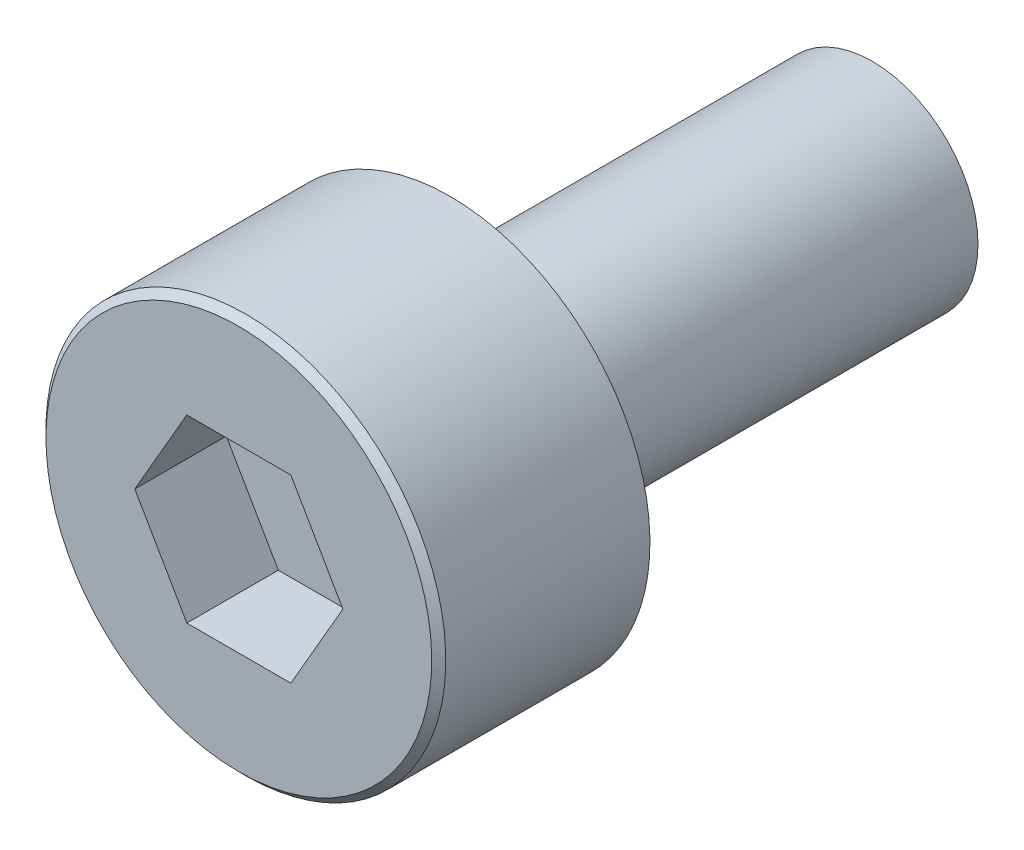
ISO-10303-21;
HEADER;
FILE_DESCRIPTION(('STEP AP214'),'2;1');
FILE_NAME('part.step','',(''),(''),'','','');
FILE_SCHEMA(('AUTOMOTIVE_DESIGN { 1 0 10303 214 1 1 1 1 }'));
ENDSEC;
DATA;
#1=APPLICATION_CONTEXT('core data for automotive mechanical design processes');
#2=APPLICATION_PROTOCOL_DEFINITION('international standard','automotive_design',2000,#1);
#3=PRODUCT_CONTEXT('',#1,'mechanical');
#4=PRODUCT('Part','Part','',(#3));
#5=PRODUCT_RELATED_PRODUCT_CATEGORY('part','',(#4));
#6=PRODUCT_DEFINITION_FORMATION('','',#4);
#7=PRODUCT_DEFINITION_CONTEXT('part definition',#1,'design');
#8=PRODUCT_DEFINITION('design','',#6,#7);
#9=PRODUCT_DEFINITION_SHAPE('','',#8);
#10=(LENGTH_UNIT() NAMED_UNIT(*) SI_UNIT(.MILLI.,.METRE.));
#11=(NAMED_UNIT(*) PLANE_ANGLE_UNIT() SI_UNIT($,.RADIAN.));
#12=(NAMED_UNIT(*) SI_UNIT($,.STERADIAN.) SOLID_ANGLE_UNIT());
#13=UNCERTAINTY_MEASURE_WITH_UNIT(LENGTH_MEASURE(1.E-05),#10,'distance_accuracy_value','');
#14=(GEOMETRIC_REPRESENTATION_CONTEXT(3) GLOBAL_UNCERTAINTY_ASSIGNED_CONTEXT((#13)) GLOBAL_UNIT_ASSIGNED_CONTEXT((#10,
#11,#12)) REPRESENTATION_CONTEXT('',''));
#15=CARTESIAN_POINT('',(0.,0.,0.));
#16=DIRECTION('',(0.,0.,1.));
#17=DIRECTION('',(1.,0.,0.));
#18=AXIS2_PLACEMENT_3D('',#15,#16,#17);
#19=CARTESIAN_POINT('',(0.,0.,0.));
#20=DIRECTION('',(0.,0.,1.));
#21=DIRECTION('',(0.,-1.,0.));
#22=AXIS2_PLACEMENT_3D('',#19,#20,#21);
#23=PLANE('',#22);
#24=CARTESIAN_POINT('',(0.,0.,0.));
#25=DIRECTION('',(0.,0.,1.));
#26=DIRECTION('',(0.,-1.,0.));
#27=AXIS2_PLACEMENT_3D('',#24,#25,#26);
#28=CIRCLE('',#27,2.74);
#29=CARTESIAN_POINT('',(0.,-2.74,0.));
#30=VERTEX_POINT('',#29);
#31=EDGE_CURVE('E11',#30,#30,#28,.T.);
#32=ORIENTED_EDGE('',*,*,#31,.T.);
#33=EDGE_LOOP('',(#32));
#34=FACE_BOUND('',#33,.T.);
#35=DIRECTION('',(-0.5,0.866025403784439,0.));
#36=VECTOR('',#35,1.);
#37=CARTESIAN_POINT('',(1.47801668912544,0.,0.));
#38=LINE('',#37,#36);
#39=CARTESIAN_POINT('',(1.47801668912544,0.,0.));
#40=VERTEX_POINT('',#39);
#41=CARTESIAN_POINT('',(0.739008344562721,1.28,0.));
#42=VERTEX_POINT('',#41);
#43=EDGE_CURVE('E58',#40,#42,#38,.T.);
#44=ORIENTED_EDGE('',*,*,#43,.F.);
#45=DIRECTION('',(0.5,0.866025403784439,0.));
#46=VECTOR('',#45,1.);
#47=CARTESIAN_POINT('',(0.739008344562721,-1.28,0.));
#48=LINE('',#47,#46);
#49=CARTESIAN_POINT('',(0.739008344562721,-1.28,0.));
#50=VERTEX_POINT('',#49);
#51=EDGE_CURVE('E141',#50,#40,#48,.T.);
#52=ORIENTED_EDGE('',*,*,#51,.F.);
#53=DIRECTION('',(1.,0.,0.));
#54=VECTOR('',#53,1.);
#55=CARTESIAN_POINT('',(-0.739008344562721,-1.28,0.));
#56=LINE('',#55,#54);
#57=CARTESIAN_POINT('',(-0.739008344562721,-1.28,0.));
#58=VERTEX_POINT('',#57);
#59=EDGE_CURVE('E139',#58,#50,#56,.T.);
#60=ORIENTED_EDGE('',*,*,#59,.F.);
#61=DIRECTION('',(0.5,-0.866025403784439,0.));
#62=VECTOR('',#61,1.);
#63=CARTESIAN_POINT('',(-1.47801668912544,0.,0.));
#64=LINE('',#63,#62);
#65=CARTESIAN_POINT('',(-1.47801668912544,0.,0.));
#66=VERTEX_POINT('',#65);
#67=EDGE_CURVE('E106',#66,#58,#64,.T.);
#68=ORIENTED_EDGE('',*,*,#67,.F.);
#69=DIRECTION('',(-0.5,-0.866025403784439,0.));
#70=VECTOR('',#69,1.);
#71=CARTESIAN_POINT('',(-0.739008344562721,1.28,0.));
#72=LINE('',#71,#70);
#73=CARTESIAN_POINT('',(-0.739008344562721,1.28,0.));
#74=VERTEX_POINT('',#73);
#75=EDGE_CURVE('E135',#74,#66,#72,.T.);
#76=ORIENTED_EDGE('',*,*,#75,.F.);
#77=DIRECTION('',(-1.,0.,0.));
#78=VECTOR('',#77,1.);
#79=CARTESIAN_POINT('',(0.739008344562721,1.28,0.));
#80=LINE('',#79,#78);
#81=EDGE_CURVE('E132',#42,#74,#80,.T.);
#82=ORIENTED_EDGE('',*,*,#81,.F.);
#83=EDGE_LOOP('',(#44,#52,#60,#68,#76,#82));
#84=FACE_BOUND('',#83,.T.);
#85=ADVANCED_FACE('F42',(#34,#84),#23,.T.);
#86=CARTESIAN_POINT('',(0.,0.,-9.));
#87=DIRECTION('',(0.,0.,-1.));
#88=DIRECTION('',(0.,1.,0.));
#89=AXIS2_PLACEMENT_3D('',#86,#87,#88);
#90=CYLINDRICAL_SURFACE('',#89,2.84);
#91=CARTESIAN_POINT('',(0.,0.,-0.0999999999999977));
#92=DIRECTION('',(0.,0.,1.));
#93=DIRECTION('',(0.,-1.,0.));
#94=AXIS2_PLACEMENT_3D('',#91,#92,#93);
#95=CIRCLE('',#94,2.84);
#96=CARTESIAN_POINT('',(0.,-2.84,-0.0999999999999981));
#97=VERTEX_POINT('',#96);
#98=EDGE_CURVE('E51',#97,#97,#95,.F.);
#99=ORIENTED_EDGE('',*,*,#98,.T.);
#100=EDGE_LOOP('',(#99));
#101=FACE_BOUND('',#100,.T.);
#102=CARTESIAN_POINT('',(0.,0.,-3.));
#103=DIRECTION('',(0.,0.,-1.));
#104=DIRECTION('',(0.,1.,0.));
#105=AXIS2_PLACEMENT_3D('',#102,#103,#104);
#106=CIRCLE('',#105,2.84);
#107=CARTESIAN_POINT('',(0.,2.84,-3.));
#108=VERTEX_POINT('',#107);
#109=EDGE_CURVE('E156',#108,#108,#106,.T.);
#110=ORIENTED_EDGE('',*,*,#109,.F.);
#111=EDGE_LOOP('',(#110));
#112=FACE_BOUND('',#111,.T.);
#113=ADVANCED_FACE('F161',(#101,#112),#90,.T.);
#114=CARTESIAN_POINT('',(0.,2.84,-3.));
#115=DIRECTION('',(0.,0.,-1.));
#116=DIRECTION('',(0.,1.,0.));
#117=AXIS2_PLACEMENT_3D('',#114,#115,#116);
#118=PLANE('',#117);
#119=ORIENTED_EDGE('',*,*,#109,.T.);
#120=EDGE_LOOP('',(#119));
#121=FACE_BOUND('',#120,.T.);
#122=CARTESIAN_POINT('',(0.,0.,-3.));
#123=DIRECTION('',(0.,0.,-1.));
#124=DIRECTION('',(0.,1.,0.));
#125=AXIS2_PLACEMENT_3D('',#122,#123,#124);
#126=CIRCLE('',#125,1.5);
#127=CARTESIAN_POINT('',(0.,1.5,-3.));
#128=VERTEX_POINT('',#127);
#129=EDGE_CURVE('E153',#128,#128,#126,.T.);
#130=ORIENTED_EDGE('',*,*,#129,.F.);
#131=EDGE_LOOP('',(#130));
#132=FACE_BOUND('',#131,.T.);
#133=ADVANCED_FACE('F177',(#121,#132),#118,.T.);
#134=CARTESIAN_POINT('',(0.,0.,-9.));
#135=DIRECTION('',(0.,0.,-1.));
#136=DIRECTION('',(0.,1.,0.));
#137=AXIS2_PLACEMENT_3D('',#134,#135,#136);
#138=CYLINDRICAL_SURFACE('',#137,1.5);
#139=ORIENTED_EDGE('',*,*,#129,.T.);
#140=EDGE_LOOP('',(#139));
#141=FACE_BOUND('',#140,.T.);
#142=CARTESIAN_POINT('',(0.,0.,-9.));
#143=DIRECTION('',(0.,0.,-1.));
#144=DIRECTION('',(0.,1.,0.));
#145=AXIS2_PLACEMENT_3D('',#142,#143,#144);
#146=CIRCLE('',#145,1.5);
#147=CARTESIAN_POINT('',(0.,1.5,-9.));
#148=VERTEX_POINT('',#147);
#149=EDGE_CURVE('E145',#148,#148,#146,.T.);
#150=ORIENTED_EDGE('',*,*,#149,.F.);
#151=EDGE_LOOP('',(#150));
#152=FACE_BOUND('',#151,.T.);
#153=ADVANCED_FACE('F183',(#141,#152),#138,.T.);
#154=CARTESIAN_POINT('',(0.,1.5,-9.));
#155=DIRECTION('',(0.,0.,-1.));
#156=DIRECTION('',(0.,1.,0.));
#157=AXIS2_PLACEMENT_3D('',#154,#155,#156);
#158=PLANE('',#157);
#159=ORIENTED_EDGE('',*,*,#149,.T.);
#160=EDGE_LOOP('',(#159));
#161=FACE_BOUND('',#160,.T.);
#162=ADVANCED_FACE('F187',(#161),#158,.T.);
#163=CARTESIAN_POINT('',(1.47801668912544,0.,-1.3));
#164=DIRECTION('',(0.866025403784439,0.5,0.));
#165=DIRECTION('',(-0.5,0.866025403784439,0.));
#166=AXIS2_PLACEMENT_3D('',#163,#164,#165);
#167=PLANE('',#166);
#168=ORIENTED_EDGE('',*,*,#43,.T.);
#169=DIRECTION('',(0.,0.,1.));
#170=VECTOR('',#169,1.);
#171=CARTESIAN_POINT('',(0.739008344562721,1.28,-1.3));
#172=LINE('',#171,#170);
#173=CARTESIAN_POINT('',(0.739008344562721,1.28,-1.3));
#174=VERTEX_POINT('',#173);
#175=EDGE_CURVE('E88',#174,#42,#172,.T.);
#176=ORIENTED_EDGE('',*,*,#175,.F.);
#177=DIRECTION('',(-0.5,0.866025403784439,0.));
#178=VECTOR('',#177,1.);
#179=CARTESIAN_POINT('',(1.47801668912544,0.,-1.3));
#180=LINE('',#179,#178);
#181=CARTESIAN_POINT('',(1.47801668912544,0.,-1.3));
#182=VERTEX_POINT('',#181);
#183=EDGE_CURVE('E143',#182,#174,#180,.T.);
#184=ORIENTED_EDGE('',*,*,#183,.F.);
#185=DIRECTION('',(0.,0.,1.));
#186=VECTOR('',#185,1.);
#187=CARTESIAN_POINT('',(1.47801668912544,0.,-1.3));
#188=LINE('',#187,#186);
#189=EDGE_CURVE('E66',#182,#40,#188,.T.);
#190=ORIENTED_EDGE('',*,*,#189,.T.);
#191=EDGE_LOOP('',(#168,#176,#184,#190));
#192=FACE_BOUND('',#191,.T.);
#193=ADVANCED_FACE('F191',(#192),#167,.F.);
#194=CARTESIAN_POINT('',(0.739008344562721,-1.28,-1.3));
#195=DIRECTION('',(0.866025403784439,-0.5,0.));
#196=DIRECTION('',(0.5,0.866025403784439,0.));
#197=AXIS2_PLACEMENT_3D('',#194,#195,#196);
#198=PLANE('',#197);
#199=ORIENTED_EDGE('',*,*,#51,.T.);
#200=ORIENTED_EDGE('',*,*,#189,.F.);
#201=DIRECTION('',(0.5,0.866025403784439,0.));
#202=VECTOR('',#201,1.);
#203=CARTESIAN_POINT('',(0.739008344562721,-1.28,-1.3));
#204=LINE('',#203,#202);
#205=CARTESIAN_POINT('',(0.739008344562721,-1.28,-1.3));
#206=VERTEX_POINT('',#205);
#207=EDGE_CURVE('E118',#206,#182,#204,.T.);
#208=ORIENTED_EDGE('',*,*,#207,.F.);
#209=DIRECTION('',(0.,0.,1.));
#210=VECTOR('',#209,1.);
#211=CARTESIAN_POINT('',(0.739008344562721,-1.28,-1.3));
#212=LINE('',#211,#210);
#213=EDGE_CURVE('E110',#206,#50,#212,.T.);
#214=ORIENTED_EDGE('',*,*,#213,.T.);
#215=EDGE_LOOP('',(#199,#200,#208,#214));
#216=FACE_BOUND('',#215,.T.);
#217=ADVANCED_FACE('F195',(#216),#198,.F.);
#218=CARTESIAN_POINT('',(-0.739008344562721,-1.28,-1.3));
#219=DIRECTION('',(0.,-1.,0.));
#220=DIRECTION('',(0.,0.,-1.));
#221=AXIS2_PLACEMENT_3D('',#218,#219,#220);
#222=PLANE('',#221);
#223=ORIENTED_EDGE('',*,*,#59,.T.);
#224=ORIENTED_EDGE('',*,*,#213,.F.);
#225=DIRECTION('',(1.,0.,0.));
#226=VECTOR('',#225,1.);
#227=CARTESIAN_POINT('',(-0.739008344562721,-1.28,-1.3));
#228=LINE('',#227,#226);
#229=CARTESIAN_POINT('',(-0.739008344562721,-1.28,-1.3));
#230=VERTEX_POINT('',#229);
#231=EDGE_CURVE('E114',#230,#206,#228,.T.);
#232=ORIENTED_EDGE('',*,*,#231,.F.);
#233=DIRECTION('',(0.,0.,1.));
#234=VECTOR('',#233,1.);
#235=CARTESIAN_POINT('',(-0.739008344562721,-1.28,-1.3));
#236=LINE('',#235,#234);
#237=EDGE_CURVE('E99',#230,#58,#236,.T.);
#238=ORIENTED_EDGE('',*,*,#237,.T.);
#239=EDGE_LOOP('',(#223,#224,#232,#238));
#240=FACE_BOUND('',#239,.T.);
#241=ADVANCED_FACE('F115',(#240),#222,.F.);
#242=CARTESIAN_POINT('',(-1.47801668912544,0.,-1.3));
#243=DIRECTION('',(-0.866025403784439,-0.5,0.));
#244=DIRECTION('',(0.5,-0.866025403784439,0.));
#245=AXIS2_PLACEMENT_3D('',#242,#243,#244);
#246=PLANE('',#245);
#247=ORIENTED_EDGE('',*,*,#67,.T.);
#248=ORIENTED_EDGE('',*,*,#237,.F.);
#249=DIRECTION('',(0.5,-0.866025403784439,0.));
#250=VECTOR('',#249,1.);
#251=CARTESIAN_POINT('',(-1.47801668912544,0.,-1.3));
#252=LINE('',#251,#250);
#253=CARTESIAN_POINT('',(-1.47801668912544,0.,-1.3));
#254=VERTEX_POINT('',#253);
#255=EDGE_CURVE('E103',#254,#230,#252,.T.);
#256=ORIENTED_EDGE('',*,*,#255,.F.);
#257=DIRECTION('',(0.,0.,1.));
#258=VECTOR('',#257,1.);
#259=CARTESIAN_POINT('',(-1.47801668912544,0.,-1.3));
#260=LINE('',#259,#258);
#261=EDGE_CURVE('E111',#254,#66,#260,.T.);
#262=ORIENTED_EDGE('',*,*,#261,.T.);
#263=EDGE_LOOP('',(#247,#248,#256,#262));
#264=FACE_BOUND('',#263,.T.);
#265=ADVANCED_FACE('F101',(#264),#246,.F.);
#266=CARTESIAN_POINT('',(-0.739008344562721,1.28,-1.3));
#267=DIRECTION('',(-0.866025403784439,0.5,0.));
#268=DIRECTION('',(-0.5,-0.866025403784439,0.));
#269=AXIS2_PLACEMENT_3D('',#266,#267,#268);
#270=PLANE('',#269);
#271=ORIENTED_EDGE('',*,*,#75,.T.);
#272=ORIENTED_EDGE('',*,*,#261,.F.);
#273=DIRECTION('',(-0.5,-0.866025403784439,0.));
#274=VECTOR('',#273,1.);
#275=CARTESIAN_POINT('',(-0.739008344562721,1.28,-1.3));
#276=LINE('',#275,#274);
#277=CARTESIAN_POINT('',(-0.739008344562721,1.28,-1.3));
#278=VERTEX_POINT('',#277);
#279=EDGE_CURVE('E124',#278,#254,#276,.T.);
#280=ORIENTED_EDGE('',*,*,#279,.F.);
#281=DIRECTION('',(0.,0.,1.));
#282=VECTOR('',#281,1.);
#283=CARTESIAN_POINT('',(-0.739008344562721,1.28,-1.3));
#284=LINE('',#283,#282);
#285=EDGE_CURVE('E148',#278,#74,#284,.T.);
#286=ORIENTED_EDGE('',*,*,#285,.T.);
#287=EDGE_LOOP('',(#271,#272,#280,#286));
#288=FACE_BOUND('',#287,.T.);
#289=ADVANCED_FACE('F198',(#288),#270,.F.);
#290=CARTESIAN_POINT('',(0.739008344562721,1.28,-1.3));
#291=DIRECTION('',(0.,1.,0.));
#292=DIRECTION('',(-1.,0.,0.));
#293=AXIS2_PLACEMENT_3D('',#290,#291,#292);
#294=PLANE('',#293);
#295=ORIENTED_EDGE('',*,*,#81,.T.);
#296=ORIENTED_EDGE('',*,*,#285,.F.);
#297=DIRECTION('',(-1.,0.,0.));
#298=VECTOR('',#297,1.);
#299=CARTESIAN_POINT('',(0.739008344562721,1.28,-1.3));
#300=LINE('',#299,#298);
#301=EDGE_CURVE('E126',#174,#278,#300,.T.);
#302=ORIENTED_EDGE('',*,*,#301,.F.);
#303=ORIENTED_EDGE('',*,*,#175,.T.);
#304=EDGE_LOOP('',(#295,#296,#302,#303));
#305=FACE_BOUND('',#304,.T.);
#306=ADVANCED_FACE('F169',(#305),#294,.F.);
#307=CARTESIAN_POINT('',(0.,0.,-1.3));
#308=DIRECTION('',(0.,0.,1.));
#309=DIRECTION('',(1.,0.,0.));
#310=AXIS2_PLACEMENT_3D('',#307,#308,#309);
#311=PLANE('',#310);
#312=ORIENTED_EDGE('',*,*,#183,.T.);
#313=ORIENTED_EDGE('',*,*,#301,.T.);
#314=ORIENTED_EDGE('',*,*,#279,.T.);
#315=ORIENTED_EDGE('',*,*,#255,.T.);
#316=ORIENTED_EDGE('',*,*,#231,.T.);
#317=ORIENTED_EDGE('',*,*,#207,.T.);
#318=EDGE_LOOP('',(#312,#313,#314,#315,#316,#317));
#319=FACE_BOUND('',#318,.T.);
#320=ADVANCED_FACE('F121',(#319),#311,.T.);
#321=CARTESIAN_POINT('',(0.,0.,-0.0999999999999977));
#322=DIRECTION('',(0.,0.,-1.));
#323=DIRECTION('',(0.,1.,0.));
#324=AXIS2_PLACEMENT_3D('',#321,#322,#323);
#325=CONICAL_SURFACE('',#324,2.84,0.785398163397448);
#326=ORIENTED_EDGE('',*,*,#31,.F.);
#327=EDGE_LOOP('',(#326));
#328=FACE_BOUND('',#327,.T.);
#329=ORIENTED_EDGE('',*,*,#98,.F.);
#330=EDGE_LOOP('',(#329));
#331=FACE_BOUND('',#330,.T.);
#332=ADVANCED_FACE('F45',(#328,#331),#325,.T.);
#333=CLOSED_SHELL('',(#85,#113,#133,#153,#162,#193,#217,#241,#265,#289,#306,#320,#332));
#334=MANIFOLD_SOLID_BREP('B2',#333);
#335=ADVANCED_BREP_SHAPE_REPRESENTATION('',(#18,#334),#14);
#336=SHAPE_DEFINITION_REPRESENTATION(#9,#335);
ENDSEC;
END-ISO-10303-21;
